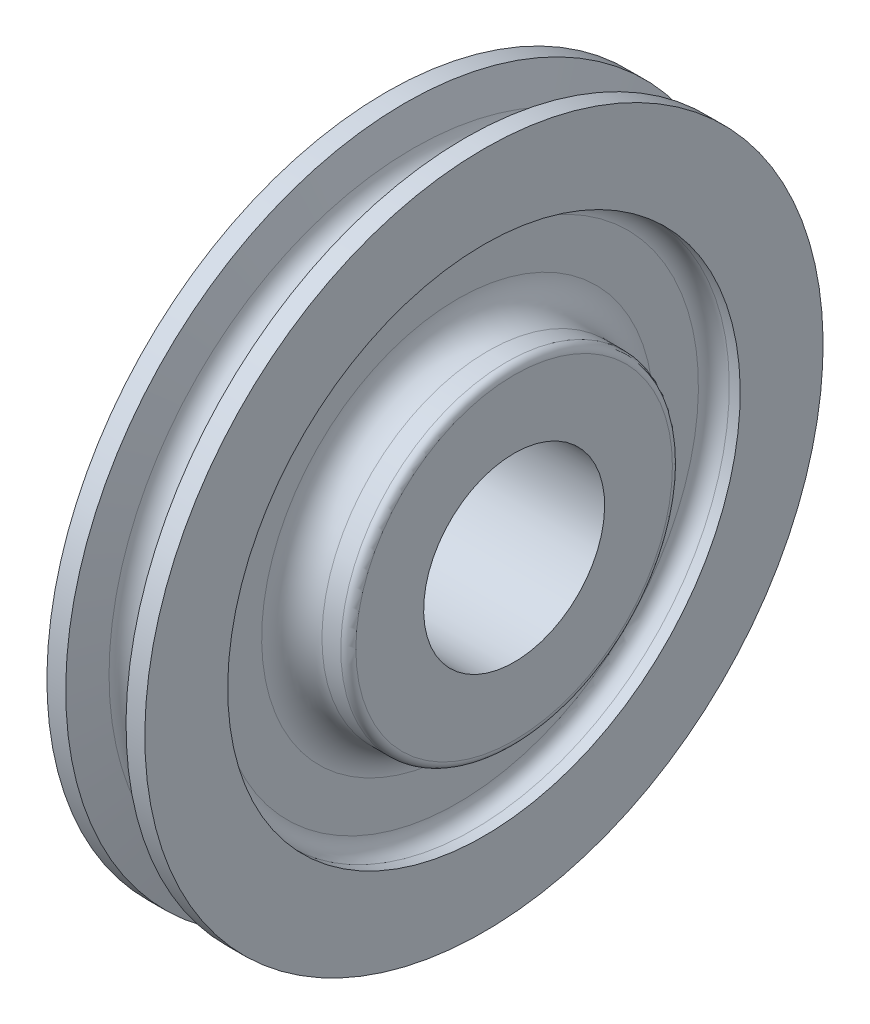
ISO-10303-21;
HEADER;
FILE_DESCRIPTION(('STEP AP214'),'2;1');
FILE_NAME('part.step','',(''),(''),'','','');
FILE_SCHEMA(('AUTOMOTIVE_DESIGN { 1 0 10303 214 1 1 1 1 }'));
ENDSEC;
DATA;
#1=APPLICATION_CONTEXT('core data for automotive mechanical design processes');
#2=APPLICATION_PROTOCOL_DEFINITION('international standard','automotive_design',2000,#1);
#3=PRODUCT_CONTEXT('',#1,'mechanical');
#4=PRODUCT('Part','Part','',(#3));
#5=PRODUCT_RELATED_PRODUCT_CATEGORY('part','',(#4));
#6=PRODUCT_DEFINITION_FORMATION('','',#4);
#7=PRODUCT_DEFINITION_CONTEXT('part definition',#1,'design');
#8=PRODUCT_DEFINITION('design','',#6,#7);
#9=PRODUCT_DEFINITION_SHAPE('','',#8);
#10=(LENGTH_UNIT() NAMED_UNIT(*) SI_UNIT(.MILLI.,.METRE.));
#11=(NAMED_UNIT(*) PLANE_ANGLE_UNIT() SI_UNIT($,.RADIAN.));
#12=(NAMED_UNIT(*) SI_UNIT($,.STERADIAN.) SOLID_ANGLE_UNIT());
#13=UNCERTAINTY_MEASURE_WITH_UNIT(LENGTH_MEASURE(1.E-05),#10,'distance_accuracy_value','');
#14=(GEOMETRIC_REPRESENTATION_CONTEXT(3) GLOBAL_UNCERTAINTY_ASSIGNED_CONTEXT((#13)) GLOBAL_UNIT_ASSIGNED_CONTEXT((#10,
#11,#12)) REPRESENTATION_CONTEXT('',''));
#15=CARTESIAN_POINT('',(0.,0.,0.));
#16=DIRECTION('',(0.,0.,1.));
#17=DIRECTION('',(1.,0.,0.));
#18=AXIS2_PLACEMENT_3D('',#15,#16,#17);
#19=CARTESIAN_POINT('',(11.1124999999992,0.,0.));
#20=DIRECTION('',(1.,0.,0.));
#21=DIRECTION('',(0.,1.,0.));
#22=AXIS2_PLACEMENT_3D('',#19,#20,#21);
#23=TOROIDAL_SURFACE('',#22,41.2750000000005,6.34999999999973);
#24=CARTESIAN_POINT('',(4.76249999999978,0.,0.));
#25=DIRECTION('',(1.,0.,0.));
#26=DIRECTION('',(0.,1.,0.));
#27=AXIS2_PLACEMENT_3D('',#24,#25,#26);
#28=CIRCLE('',#27,41.2749999999999);
#29=CARTESIAN_POINT('',(4.7625,41.2749999999999,0.));
#30=VERTEX_POINT('',#29);
#31=EDGE_CURVE('E10',#30,#30,#28,.T.);
#32=ORIENTED_EDGE('',*,*,#31,.T.);
#33=EDGE_LOOP('',(#32));
#34=FACE_BOUND('',#33,.T.);
#35=CARTESIAN_POINT('',(11.1124999999995,0.,0.));
#36=DIRECTION('',(1.,0.,0.));
#37=DIRECTION('',(0.,1.,0.));
#38=AXIS2_PLACEMENT_3D('',#35,#36,#37);
#39=CIRCLE('',#38,34.9250000000005);
#40=CARTESIAN_POINT('',(11.1124999999996,34.9250000000005,0.));
#41=VERTEX_POINT('',#40);
#42=EDGE_CURVE('E416',#41,#41,#39,.T.);
#43=ORIENTED_EDGE('',*,*,#42,.F.);
#44=EDGE_LOOP('',(#43));
#45=FACE_BOUND('',#44,.T.);
#46=ADVANCED_FACE('F352',(#34,#45),#23,.F.);
#47=CARTESIAN_POINT('',(4.76250000000003,50.7237999999999,0.));
#48=DIRECTION('',(1.,0.,0.));
#49=DIRECTION('',(0.,1.,0.));
#50=AXIS2_PLACEMENT_3D('',#47,#48,#49);
#51=PLANE('',#50);
#52=CARTESIAN_POINT('',(4.76249999999973,0.,0.));
#53=DIRECTION('',(1.,0.,0.));
#54=DIRECTION('',(0.,1.,0.));
#55=AXIS2_PLACEMENT_3D('',#52,#53,#54);
#56=CIRCLE('',#55,50.7237999999999);
#57=CARTESIAN_POINT('',(4.7625,50.7237999999999,0.));
#58=VERTEX_POINT('',#57);
#59=EDGE_CURVE('E358',#58,#58,#56,.T.);
#60=ORIENTED_EDGE('',*,*,#59,.T.);
#61=EDGE_LOOP('',(#60));
#62=FACE_BOUND('',#61,.T.);
#63=ORIENTED_EDGE('',*,*,#31,.F.);
#64=EDGE_LOOP('',(#63));
#65=FACE_BOUND('',#64,.T.);
#66=ADVANCED_FACE('F447',(#62,#65),#51,.T.);
#67=CARTESIAN_POINT('',(8.01369999999973,0.,0.));
#68=DIRECTION('',(1.,0.,0.));
#69=DIRECTION('',(0.,1.,0.));
#70=AXIS2_PLACEMENT_3D('',#67,#68,#69);
#71=TOROIDAL_SURFACE('',#70,50.7238,3.25120000000001);
#72=CARTESIAN_POINT('',(8.01369999999971,0.,0.));
#73=DIRECTION('',(1.,0.,0.));
#74=DIRECTION('',(0.,1.,0.));
#75=AXIS2_PLACEMENT_3D('',#72,#73,#74);
#76=CIRCLE('',#75,53.975);
#77=CARTESIAN_POINT('',(8.0137,53.9749999999999,0.));
#78=VERTEX_POINT('',#77);
#79=EDGE_CURVE('E362',#78,#78,#76,.T.);
#80=ORIENTED_EDGE('',*,*,#79,.T.);
#81=EDGE_LOOP('',(#80));
#82=FACE_BOUND('',#81,.T.);
#83=ORIENTED_EDGE('',*,*,#59,.F.);
#84=EDGE_LOOP('',(#83));
#85=FACE_BOUND('',#84,.T.);
#86=ADVANCED_FACE('F451',(#82,#85),#71,.F.);
#87=CARTESIAN_POINT('',(16.66875,0.,0.));
#88=DIRECTION('',(1.,0.,0.));
#89=DIRECTION('',(0.,1.,0.));
#90=AXIS2_PLACEMENT_3D('',#87,#88,#89);
#91=CYLINDRICAL_SURFACE('',#90,53.9750000000002);
#92=CARTESIAN_POINT('',(10.3123999999997,0.,0.));
#93=DIRECTION('',(1.,0.,0.));
#94=DIRECTION('',(0.,1.,0.));
#95=AXIS2_PLACEMENT_3D('',#92,#93,#94);
#96=CIRCLE('',#95,53.9750000000004);
#97=CARTESIAN_POINT('',(10.3124,53.9750000000003,0.));
#98=VERTEX_POINT('',#97);
#99=EDGE_CURVE('E366',#98,#98,#96,.T.);
#100=ORIENTED_EDGE('',*,*,#99,.T.);
#101=EDGE_LOOP('',(#100));
#102=FACE_BOUND('',#101,.T.);
#103=ORIENTED_EDGE('',*,*,#79,.F.);
#104=EDGE_LOOP('',(#103));
#105=FACE_BOUND('',#104,.T.);
#106=ADVANCED_FACE('F459',(#102,#105),#91,.F.);
#107=CARTESIAN_POINT('',(10.3124,71.4311499999999,0.));
#108=DIRECTION('',(1.,0.,0.));
#109=DIRECTION('',(0.,1.,0.));
#110=AXIS2_PLACEMENT_3D('',#107,#108,#109);
#111=PLANE('',#110);
#112=CARTESIAN_POINT('',(10.3123999999996,0.,0.));
#113=DIRECTION('',(1.,0.,0.));
#114=DIRECTION('',(0.,1.,0.));
#115=AXIS2_PLACEMENT_3D('',#112,#113,#114);
#116=CIRCLE('',#115,71.43115);
#117=CARTESIAN_POINT('',(10.3124,71.4311499999999,0.));
#118=VERTEX_POINT('',#117);
#119=EDGE_CURVE('E371',#118,#118,#116,.T.);
#120=ORIENTED_EDGE('',*,*,#119,.T.);
#121=EDGE_LOOP('',(#120));
#122=FACE_BOUND('',#121,.T.);
#123=ORIENTED_EDGE('',*,*,#99,.F.);
#124=EDGE_LOOP('',(#123));
#125=FACE_BOUND('',#124,.T.);
#126=ADVANCED_FACE('F466',(#122,#125),#111,.T.);
#127=CARTESIAN_POINT('',(16.66875,0.,0.));
#128=DIRECTION('',(1.,0.,0.));
#129=DIRECTION('',(0.,1.,0.));
#130=AXIS2_PLACEMENT_3D('',#127,#128,#129);
#131=CYLINDRICAL_SURFACE('',#130,71.4311499999999);
#132=CARTESIAN_POINT('',(6.34999999999962,0.,0.));
#133=DIRECTION('',(1.,0.,0.));
#134=DIRECTION('',(0.,1.,0.));
#135=AXIS2_PLACEMENT_3D('',#132,#133,#134);
#136=CIRCLE('',#135,71.4311499999999);
#137=CARTESIAN_POINT('',(6.35,71.4311499999999,0.));
#138=VERTEX_POINT('',#137);
#139=EDGE_CURVE('E374',#138,#138,#136,.T.);
#140=ORIENTED_EDGE('',*,*,#139,.T.);
#141=EDGE_LOOP('',(#140));
#142=FACE_BOUND('',#141,.T.);
#143=ORIENTED_EDGE('',*,*,#119,.F.);
#144=EDGE_LOOP('',(#143));
#145=FACE_BOUND('',#144,.T.);
#146=ADVANCED_FACE('F470',(#142,#145),#131,.T.);
#147=CARTESIAN_POINT('',(6.34999999999962,0.,0.));
#148=DIRECTION('',(1.,0.,0.));
#149=DIRECTION('',(0.,1.,0.));
#150=AXIS2_PLACEMENT_3D('',#147,#148,#149);
#151=CONICAL_SURFACE('',#150,71.4311499999999,1.34420065973755);
#152=CARTESIAN_POINT('',(4.64075555889559,0.,0.));
#153=DIRECTION('',(1.,0.,0.));
#154=DIRECTION('',(0.,1.,0.));
#155=AXIS2_PLACEMENT_3D('',#152,#153,#154);
#156=CIRCLE('',#155,64.0175494905948);
#157=CARTESIAN_POINT('',(4.64075555889594,64.0175494905947,0.));
#158=VERTEX_POINT('',#157);
#159=EDGE_CURVE('E377',#158,#158,#156,.T.);
#160=ORIENTED_EDGE('',*,*,#159,.T.);
#161=EDGE_LOOP('',(#160));
#162=FACE_BOUND('',#161,.T.);
#163=ORIENTED_EDGE('',*,*,#139,.F.);
#164=EDGE_LOOP('',(#163));
#165=FACE_BOUND('',#164,.T.);
#166=ADVANCED_FACE('F474',(#162,#165),#151,.T.);
#167=CARTESIAN_POINT('',(-3.53883589099269E-13,0.,0.));
#168=DIRECTION('',(1.,0.,0.));
#169=DIRECTION('',(0.,1.,0.));
#170=AXIS2_PLACEMENT_3D('',#167,#168,#169);
#171=TOROIDAL_SURFACE('',#170,65.0874999999999,4.7625);
#172=CARTESIAN_POINT('',(-4.64075555889628,0.,0.));
#173=DIRECTION('',(1.,0.,0.));
#174=DIRECTION('',(0.,1.,0.));
#175=AXIS2_PLACEMENT_3D('',#172,#173,#174);
#176=CIRCLE('',#175,64.0175494905947);
#177=CARTESIAN_POINT('',(-4.64075555889593,64.0175494905947,0.));
#178=VERTEX_POINT('',#177);
#179=EDGE_CURVE('E380',#178,#178,#176,.T.);
#180=ORIENTED_EDGE('',*,*,#179,.T.);
#181=EDGE_LOOP('',(#180));
#182=FACE_BOUND('',#181,.T.);
#183=ORIENTED_EDGE('',*,*,#159,.F.);
#184=EDGE_LOOP('',(#183));
#185=FACE_BOUND('',#184,.T.);
#186=ADVANCED_FACE('F478',(#182,#185),#171,.F.);
#187=CARTESIAN_POINT('',(-4.64075555889628,0.,0.));
#188=DIRECTION('',(-1.,0.,0.));
#189=DIRECTION('',(0.,-1.,0.));
#190=AXIS2_PLACEMENT_3D('',#187,#188,#189);
#191=CONICAL_SURFACE('',#190,64.0175494905947,1.34420065973754);
#192=CARTESIAN_POINT('',(-6.35000000000039,0.,0.));
#193=DIRECTION('',(1.,0.,0.));
#194=DIRECTION('',(0.,1.,0.));
#195=AXIS2_PLACEMENT_3D('',#192,#193,#194);
#196=CIRCLE('',#195,71.4311499999999);
#197=CARTESIAN_POINT('',(-6.35,71.4311499999999,0.));
#198=VERTEX_POINT('',#197);
#199=EDGE_CURVE('E383',#198,#198,#196,.T.);
#200=ORIENTED_EDGE('',*,*,#199,.T.);
#201=EDGE_LOOP('',(#200));
#202=FACE_BOUND('',#201,.T.);
#203=ORIENTED_EDGE('',*,*,#179,.F.);
#204=EDGE_LOOP('',(#203));
#205=FACE_BOUND('',#204,.T.);
#206=ADVANCED_FACE('F482',(#202,#205),#191,.T.);
#207=CARTESIAN_POINT('',(16.66875,0.,0.));
#208=DIRECTION('',(1.,0.,0.));
#209=DIRECTION('',(0.,1.,0.));
#210=AXIS2_PLACEMENT_3D('',#207,#208,#209);
#211=CYLINDRICAL_SURFACE('',#210,71.4311499999998);
#212=CARTESIAN_POINT('',(-10.3124000000004,0.,0.));
#213=DIRECTION('',(1.,0.,0.));
#214=DIRECTION('',(0.,1.,0.));
#215=AXIS2_PLACEMENT_3D('',#212,#213,#214);
#216=CIRCLE('',#215,71.4311499999998);
#217=CARTESIAN_POINT('',(-10.3124,71.4311499999999,0.));
#218=VERTEX_POINT('',#217);
#219=EDGE_CURVE('E386',#218,#218,#216,.T.);
#220=ORIENTED_EDGE('',*,*,#219,.T.);
#221=EDGE_LOOP('',(#220));
#222=FACE_BOUND('',#221,.T.);
#223=ORIENTED_EDGE('',*,*,#199,.F.);
#224=EDGE_LOOP('',(#223));
#225=FACE_BOUND('',#224,.T.);
#226=ADVANCED_FACE('F486',(#222,#225),#211,.T.);
#227=CARTESIAN_POINT('',(-10.3123999999999,71.4311499999999,0.));
#228=DIRECTION('',(-1.,0.,0.));
#229=DIRECTION('',(0.,-1.,0.));
#230=AXIS2_PLACEMENT_3D('',#227,#228,#229);
#231=PLANE('',#230);
#232=CARTESIAN_POINT('',(-10.3124000000003,0.,0.));
#233=DIRECTION('',(1.,0.,0.));
#234=DIRECTION('',(0.,1.,0.));
#235=AXIS2_PLACEMENT_3D('',#232,#233,#234);
#236=CIRCLE('',#235,53.9750000000003);
#237=CARTESIAN_POINT('',(-10.3124,53.9750000000003,0.));
#238=VERTEX_POINT('',#237);
#239=EDGE_CURVE('E389',#238,#238,#236,.T.);
#240=ORIENTED_EDGE('',*,*,#239,.T.);
#241=EDGE_LOOP('',(#240));
#242=FACE_BOUND('',#241,.T.);
#243=ORIENTED_EDGE('',*,*,#219,.F.);
#244=EDGE_LOOP('',(#243));
#245=FACE_BOUND('',#244,.T.);
#246=ADVANCED_FACE('F490',(#242,#245),#231,.T.);
#247=CARTESIAN_POINT('',(16.66875,0.,0.));
#248=DIRECTION('',(1.,0.,0.));
#249=DIRECTION('',(0.,1.,0.));
#250=AXIS2_PLACEMENT_3D('',#247,#248,#249);
#251=CYLINDRICAL_SURFACE('',#250,53.9750000000001);
#252=CARTESIAN_POINT('',(-8.0137000000003,0.,0.));
#253=DIRECTION('',(1.,0.,0.));
#254=DIRECTION('',(0.,1.,0.));
#255=AXIS2_PLACEMENT_3D('',#252,#253,#254);
#256=CIRCLE('',#255,53.9749999999999);
#257=CARTESIAN_POINT('',(-8.01370000000001,53.9749999999999,0.));
#258=VERTEX_POINT('',#257);
#259=EDGE_CURVE('E392',#258,#258,#256,.T.);
#260=ORIENTED_EDGE('',*,*,#259,.T.);
#261=EDGE_LOOP('',(#260));
#262=FACE_BOUND('',#261,.T.);
#263=ORIENTED_EDGE('',*,*,#239,.F.);
#264=EDGE_LOOP('',(#263));
#265=FACE_BOUND('',#264,.T.);
#266=ADVANCED_FACE('F494',(#262,#265),#251,.F.);
#267=CARTESIAN_POINT('',(-8.01370000000028,0.,0.));
#268=DIRECTION('',(1.,0.,0.));
#269=DIRECTION('',(0.,1.,0.));
#270=AXIS2_PLACEMENT_3D('',#267,#268,#269);
#271=TOROIDAL_SURFACE('',#270,50.7237999999999,3.25120000000001);
#272=CARTESIAN_POINT('',(-4.76250000000027,0.,0.));
#273=DIRECTION('',(1.,0.,0.));
#274=DIRECTION('',(0.,1.,0.));
#275=AXIS2_PLACEMENT_3D('',#272,#273,#274);
#276=CIRCLE('',#275,50.7237999999999);
#277=CARTESIAN_POINT('',(-4.76249999999999,50.7237999999999,0.));
#278=VERTEX_POINT('',#277);
#279=EDGE_CURVE('E395',#278,#278,#276,.T.);
#280=ORIENTED_EDGE('',*,*,#279,.T.);
#281=EDGE_LOOP('',(#280));
#282=FACE_BOUND('',#281,.T.);
#283=ORIENTED_EDGE('',*,*,#259,.F.);
#284=EDGE_LOOP('',(#283));
#285=FACE_BOUND('',#284,.T.);
#286=ADVANCED_FACE('F498',(#282,#285),#271,.F.);
#287=CARTESIAN_POINT('',(-4.76249999999997,50.7237999999999,0.));
#288=DIRECTION('',(-1.,0.,0.));
#289=DIRECTION('',(0.,-1.,0.));
#290=AXIS2_PLACEMENT_3D('',#287,#288,#289);
#291=PLANE('',#290);
#292=CARTESIAN_POINT('',(-4.76250000000022,0.,0.));
#293=DIRECTION('',(1.,0.,0.));
#294=DIRECTION('',(0.,1.,0.));
#295=AXIS2_PLACEMENT_3D('',#292,#293,#294);
#296=CIRCLE('',#295,41.2749999999999);
#297=CARTESIAN_POINT('',(-4.7625,41.2749999999999,0.));
#298=VERTEX_POINT('',#297);
#299=EDGE_CURVE('E398',#298,#298,#296,.T.);
#300=ORIENTED_EDGE('',*,*,#299,.T.);
#301=EDGE_LOOP('',(#300));
#302=FACE_BOUND('',#301,.T.);
#303=ORIENTED_EDGE('',*,*,#279,.F.);
#304=EDGE_LOOP('',(#303));
#305=FACE_BOUND('',#304,.T.);
#306=ADVANCED_FACE('F502',(#302,#305),#291,.T.);
#307=CARTESIAN_POINT('',(-11.1125000000008,0.,0.));
#308=DIRECTION('',(1.,0.,0.));
#309=DIRECTION('',(0.,1.,0.));
#310=AXIS2_PLACEMENT_3D('',#307,#308,#309);
#311=TOROIDAL_SURFACE('',#310,41.275,6.35000000000027);
#312=CARTESIAN_POINT('',(-11.1125000000006,0.,0.));
#313=DIRECTION('',(1.,0.,0.));
#314=DIRECTION('',(0.,1.,0.));
#315=AXIS2_PLACEMENT_3D('',#312,#313,#314);
#316=CIRCLE('',#315,34.9249999999998);
#317=CARTESIAN_POINT('',(-11.1125000000004,34.9249999999998,0.));
#318=VERTEX_POINT('',#317);
#319=EDGE_CURVE('E401',#318,#318,#316,.T.);
#320=ORIENTED_EDGE('',*,*,#319,.T.);
#321=EDGE_LOOP('',(#320));
#322=FACE_BOUND('',#321,.T.);
#323=ORIENTED_EDGE('',*,*,#299,.F.);
#324=EDGE_LOOP('',(#323));
#325=FACE_BOUND('',#324,.T.);
#326=ADVANCED_FACE('F506',(#322,#325),#311,.F.);
#327=CARTESIAN_POINT('',(16.66875,0.,0.));
#328=DIRECTION('',(1.,0.,0.));
#329=DIRECTION('',(0.,1.,0.));
#330=AXIS2_PLACEMENT_3D('',#327,#328,#329);
#331=CYLINDRICAL_SURFACE('',#330,34.9249999999999);
#332=CARTESIAN_POINT('',(-15.0812500000002,0.,0.));
#333=DIRECTION('',(1.,0.,0.));
#334=DIRECTION('',(0.,1.,0.));
#335=AXIS2_PLACEMENT_3D('',#332,#333,#334);
#336=CIRCLE('',#335,34.925);
#337=CARTESIAN_POINT('',(-15.08125,34.9250000000001,0.));
#338=VERTEX_POINT('',#337);
#339=EDGE_CURVE('E404',#338,#338,#336,.T.);
#340=ORIENTED_EDGE('',*,*,#339,.T.);
#341=EDGE_LOOP('',(#340));
#342=FACE_BOUND('',#341,.T.);
#343=ORIENTED_EDGE('',*,*,#319,.F.);
#344=EDGE_LOOP('',(#343));
#345=FACE_BOUND('',#344,.T.);
#346=ADVANCED_FACE('F510',(#342,#345),#331,.T.);
#347=CARTESIAN_POINT('',(-15.0812500000002,0.,0.));
#348=DIRECTION('',(1.,0.,0.));
#349=DIRECTION('',(0.,1.,0.));
#350=AXIS2_PLACEMENT_3D('',#347,#348,#349);
#351=TOROIDAL_SURFACE('',#350,33.3375,1.5875);
#352=CARTESIAN_POINT('',(-16.6687500000002,0.,0.));
#353=DIRECTION('',(1.,0.,0.));
#354=DIRECTION('',(0.,1.,0.));
#355=AXIS2_PLACEMENT_3D('',#352,#353,#354);
#356=CIRCLE('',#355,33.3375);
#357=CARTESIAN_POINT('',(-16.66875,33.3375000000001,0.));
#358=VERTEX_POINT('',#357);
#359=EDGE_CURVE('E407',#358,#358,#356,.T.);
#360=ORIENTED_EDGE('',*,*,#359,.T.);
#361=EDGE_LOOP('',(#360));
#362=FACE_BOUND('',#361,.T.);
#363=ORIENTED_EDGE('',*,*,#339,.F.);
#364=EDGE_LOOP('',(#363));
#365=FACE_BOUND('',#364,.T.);
#366=ADVANCED_FACE('F514',(#362,#365),#351,.T.);
#367=CARTESIAN_POINT('',(-16.6687499999999,33.3375000000001,0.));
#368=DIRECTION('',(-1.,0.,0.));
#369=DIRECTION('',(0.,-1.,0.));
#370=AXIS2_PLACEMENT_3D('',#367,#368,#369);
#371=PLANE('',#370);
#372=CARTESIAN_POINT('',(-16.6687500000004,0.,0.));
#373=DIRECTION('',(1.,0.,0.));
#374=DIRECTION('',(0.,1.,0.));
#375=AXIS2_PLACEMENT_3D('',#372,#373,#374);
#376=CIRCLE('',#375,19.0627);
#377=CARTESIAN_POINT('',(-16.6687500000003,19.0627000000001,0.));
#378=VERTEX_POINT('',#377);
#379=EDGE_CURVE('E419',#378,#378,#376,.T.);
#380=ORIENTED_EDGE('',*,*,#379,.T.);
#381=EDGE_LOOP('',(#380));
#382=FACE_BOUND('',#381,.T.);
#383=ORIENTED_EDGE('',*,*,#359,.F.);
#384=EDGE_LOOP('',(#383));
#385=FACE_BOUND('',#384,.T.);
#386=ADVANCED_FACE('F432',(#382,#385),#371,.T.);
#387=CARTESIAN_POINT('',(16.66875,33.3375000000005,0.));
#388=DIRECTION('',(1.,0.,0.));
#389=DIRECTION('',(0.,1.,0.));
#390=AXIS2_PLACEMENT_3D('',#387,#388,#389);
#391=PLANE('',#390);
#392=CARTESIAN_POINT('',(16.6687499999998,0.,0.));
#393=DIRECTION('',(1.,0.,0.));
#394=DIRECTION('',(0.,1.,0.));
#395=AXIS2_PLACEMENT_3D('',#392,#393,#394);
#396=CIRCLE('',#395,19.0627);
#397=CARTESIAN_POINT('',(16.6687499999999,19.0626999999999,0.));
#398=VERTEX_POINT('',#397);
#399=EDGE_CURVE('E422',#398,#398,#396,.T.);
#400=ORIENTED_EDGE('',*,*,#399,.F.);
#401=EDGE_LOOP('',(#400));
#402=FACE_BOUND('',#401,.T.);
#403=CARTESIAN_POINT('',(16.6687499999996,0.,0.));
#404=DIRECTION('',(1.,0.,0.));
#405=DIRECTION('',(0.,1.,0.));
#406=AXIS2_PLACEMENT_3D('',#403,#404,#405);
#407=CIRCLE('',#406,33.3375000000006);
#408=CARTESIAN_POINT('',(16.6687499999998,33.3375000000005,0.));
#409=VERTEX_POINT('',#408);
#410=EDGE_CURVE('E410',#409,#409,#407,.T.);
#411=ORIENTED_EDGE('',*,*,#410,.T.);
#412=EDGE_LOOP('',(#411));
#413=FACE_BOUND('',#412,.T.);
#414=ADVANCED_FACE('F428',(#402,#413),#391,.T.);
#415=CARTESIAN_POINT('',(15.0812499999996,0.,0.));
#416=DIRECTION('',(1.,0.,0.));
#417=DIRECTION('',(0.,1.,0.));
#418=AXIS2_PLACEMENT_3D('',#415,#416,#417);
#419=TOROIDAL_SURFACE('',#418,33.3375000000005,1.5875);
#420=CARTESIAN_POINT('',(15.0812499999996,0.,0.));
#421=DIRECTION('',(1.,0.,0.));
#422=DIRECTION('',(0.,1.,0.));
#423=AXIS2_PLACEMENT_3D('',#420,#421,#422);
#424=CIRCLE('',#423,34.9250000000005);
#425=CARTESIAN_POINT('',(15.0812499999998,34.9250000000005,0.));
#426=VERTEX_POINT('',#425);
#427=EDGE_CURVE('E413',#426,#426,#424,.T.);
#428=ORIENTED_EDGE('',*,*,#427,.T.);
#429=EDGE_LOOP('',(#428));
#430=FACE_BOUND('',#429,.T.);
#431=ORIENTED_EDGE('',*,*,#410,.F.);
#432=EDGE_LOOP('',(#431));
#433=FACE_BOUND('',#432,.T.);
#434=ADVANCED_FACE('F431',(#430,#433),#419,.T.);
#435=CARTESIAN_POINT('',(16.66875,0.,0.));
#436=DIRECTION('',(1.,0.,0.));
#437=DIRECTION('',(0.,1.,0.));
#438=AXIS2_PLACEMENT_3D('',#435,#436,#437);
#439=CYLINDRICAL_SURFACE('',#438,34.9250000000005);
#440=ORIENTED_EDGE('',*,*,#42,.T.);
#441=EDGE_LOOP('',(#440));
#442=FACE_BOUND('',#441,.T.);
#443=ORIENTED_EDGE('',*,*,#427,.F.);
#444=EDGE_LOOP('',(#443));
#445=FACE_BOUND('',#444,.T.);
#446=ADVANCED_FACE('F437',(#442,#445),#439,.T.);
#447=CARTESIAN_POINT('',(-16.6687500000004,0.,0.));
#448=DIRECTION('',(1.,0.,0.));
#449=DIRECTION('',(0.,1.,0.));
#450=AXIS2_PLACEMENT_3D('',#447,#448,#449);
#451=CYLINDRICAL_SURFACE('',#450,19.0627);
#452=ORIENTED_EDGE('',*,*,#379,.F.);
#453=EDGE_LOOP('',(#452));
#454=FACE_BOUND('',#453,.T.);
#455=ORIENTED_EDGE('',*,*,#399,.T.);
#456=EDGE_LOOP('',(#455));
#457=FACE_BOUND('',#456,.T.);
#458=ADVANCED_FACE('F426',(#454,#457),#451,.F.);
#459=CLOSED_SHELL('',(#46,#66,#86,#106,#126,#146,#166,#186,#206,#226,#246,#266,#286,#306,#326,
#346,#366,#386,#414,#434,#446,#458));
#460=MANIFOLD_SOLID_BREP('B2',#459);
#461=ADVANCED_BREP_SHAPE_REPRESENTATION('',(#18,#460),#14);
#462=SHAPE_DEFINITION_REPRESENTATION(#9,#461);
ENDSEC;
END-ISO-10303-21;
